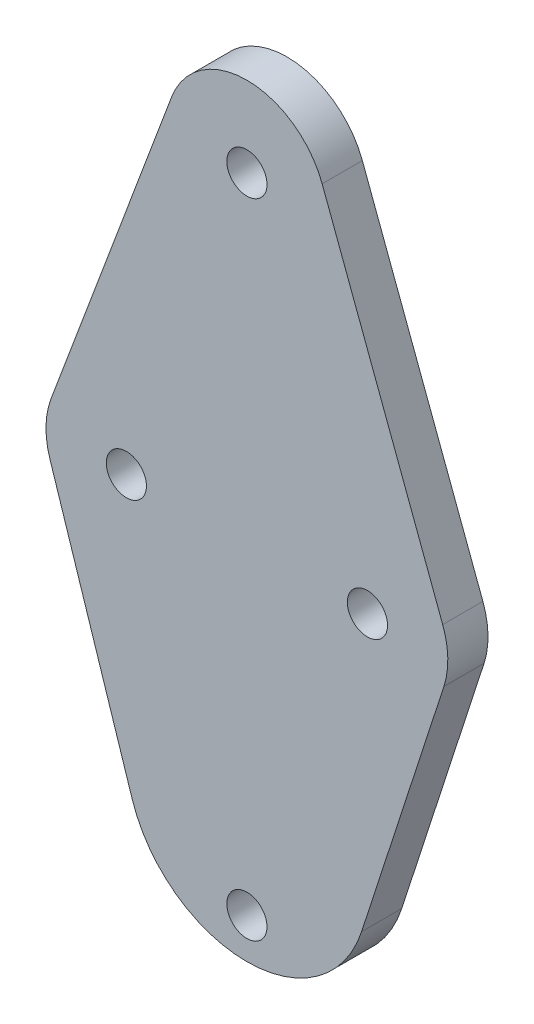
ISO-10303-21;
HEADER;
FILE_DESCRIPTION(('STEP AP214'),'2;1');
FILE_NAME('part.step','',(''),(''),'','','');
FILE_SCHEMA(('AUTOMOTIVE_DESIGN { 1 0 10303 214 1 1 1 1 }'));
ENDSEC;
DATA;
#1=APPLICATION_CONTEXT('core data for automotive mechanical design processes');
#2=APPLICATION_PROTOCOL_DEFINITION('international standard','automotive_design',2000,#1);
#3=PRODUCT_CONTEXT('',#1,'mechanical');
#4=PRODUCT('Part','Part','',(#3));
#5=PRODUCT_RELATED_PRODUCT_CATEGORY('part','',(#4));
#6=PRODUCT_DEFINITION_FORMATION('','',#4);
#7=PRODUCT_DEFINITION_CONTEXT('part definition',#1,'design');
#8=PRODUCT_DEFINITION('design','',#6,#7);
#9=PRODUCT_DEFINITION_SHAPE('','',#8);
#10=(LENGTH_UNIT() NAMED_UNIT(*) SI_UNIT(.MILLI.,.METRE.));
#11=(NAMED_UNIT(*) PLANE_ANGLE_UNIT() SI_UNIT($,.RADIAN.));
#12=(NAMED_UNIT(*) SI_UNIT($,.STERADIAN.) SOLID_ANGLE_UNIT());
#13=UNCERTAINTY_MEASURE_WITH_UNIT(LENGTH_MEASURE(1.E-05),#10,'distance_accuracy_value','');
#14=(GEOMETRIC_REPRESENTATION_CONTEXT(3) GLOBAL_UNCERTAINTY_ASSIGNED_CONTEXT((#13)) GLOBAL_UNIT_ASSIGNED_CONTEXT((#10,
#11,#12)) REPRESENTATION_CONTEXT('',''));
#15=CARTESIAN_POINT('',(0.,0.,0.));
#16=DIRECTION('',(0.,0.,1.));
#17=DIRECTION('',(1.,0.,0.));
#18=AXIS2_PLACEMENT_3D('',#15,#16,#17);
#19=CARTESIAN_POINT('',(0.,40.,5.));
#20=DIRECTION('',(0.,0.,-1.));
#21=DIRECTION('',(-1.,0.,0.));
#22=AXIS2_PLACEMENT_3D('',#19,#20,#21);
#23=CYLINDRICAL_SURFACE('',#22,10.);
#24=CARTESIAN_POINT('',(0.,40.,0.));
#25=DIRECTION('',(0.,0.,1.));
#26=DIRECTION('',(1.,0.,0.));
#27=AXIS2_PLACEMENT_3D('',#24,#25,#26);
#28=CIRCLE('',#27,10.);
#29=CARTESIAN_POINT('',(9.36329177569045,43.5112344158839,0.));
#30=VERTEX_POINT('',#29);
#31=CARTESIAN_POINT('',(-9.36329177569045,43.5112344158839,0.));
#32=VERTEX_POINT('',#31);
#33=EDGE_CURVE('E143',#30,#32,#28,.T.);
#34=ORIENTED_EDGE('',*,*,#33,.T.);
#35=DIRECTION('',(0.,0.,-1.));
#36=VECTOR('',#35,1.);
#37=CARTESIAN_POINT('',(-9.36329177569045,43.5112344158839,5.));
#38=LINE('',#37,#36);
#39=CARTESIAN_POINT('',(-9.36329177569045,43.5112344158839,5.));
#40=VERTEX_POINT('',#39);
#41=EDGE_CURVE('E11',#40,#32,#38,.T.);
#42=ORIENTED_EDGE('',*,*,#41,.F.);
#43=CARTESIAN_POINT('',(0.,40.,5.));
#44=DIRECTION('',(0.,0.,1.));
#45=DIRECTION('',(1.,0.,0.));
#46=AXIS2_PLACEMENT_3D('',#43,#44,#45);
#47=CIRCLE('',#46,10.);
#48=CARTESIAN_POINT('',(9.36329177569045,43.5112344158839,5.));
#49=VERTEX_POINT('',#48);
#50=EDGE_CURVE('E166',#49,#40,#47,.T.);
#51=ORIENTED_EDGE('',*,*,#50,.F.);
#52=DIRECTION('',(0.,0.,-1.));
#53=VECTOR('',#52,1.);
#54=CARTESIAN_POINT('',(9.36329177569045,43.5112344158839,5.));
#55=LINE('',#54,#53);
#56=EDGE_CURVE('E139',#49,#30,#55,.T.);
#57=ORIENTED_EDGE('',*,*,#56,.T.);
#58=EDGE_LOOP('',(#34,#42,#51,#57));
#59=FACE_BOUND('',#58,.T.);
#60=ADVANCED_FACE('F42',(#59),#23,.T.);
#61=CARTESIAN_POINT('',(-9.36329177569045,43.5112344158839,5.));
#62=DIRECTION('',(0.936329177569044,-0.351123441588392,0.));
#63=DIRECTION('',(0.351123441588392,0.936329177569044,0.));
#64=AXIS2_PLACEMENT_3D('',#61,#62,#63);
#65=PLANE('',#64);
#66=DIRECTION('',(-0.351123441588392,-0.936329177569044,0.));
#67=VECTOR('',#66,1.);
#68=CARTESIAN_POINT('',(-9.36329177569045,43.5112344158839,0.));
#69=LINE('',#68,#67);
#70=CARTESIAN_POINT('',(-24.3632917756905,3.51123441588391,0.));
#71=VERTEX_POINT('',#70);
#72=EDGE_CURVE('E147',#32,#71,#69,.T.);
#73=ORIENTED_EDGE('',*,*,#72,.T.);
#74=DIRECTION('',(0.,0.,-1.));
#75=VECTOR('',#74,1.);
#76=CARTESIAN_POINT('',(-24.3632917756905,3.51123441588391,5.));
#77=LINE('',#76,#75);
#78=CARTESIAN_POINT('',(-24.3632917756905,3.51123441588391,5.));
#79=VERTEX_POINT('',#78);
#80=EDGE_CURVE('E51',#79,#71,#77,.T.);
#81=ORIENTED_EDGE('',*,*,#80,.F.);
#82=DIRECTION('',(-0.351123441588392,-0.936329177569044,0.));
#83=VECTOR('',#82,1.);
#84=CARTESIAN_POINT('',(-9.36329177569045,43.5112344158839,5.));
#85=LINE('',#84,#83);
#86=EDGE_CURVE('E102',#40,#79,#85,.T.);
#87=ORIENTED_EDGE('',*,*,#86,.F.);
#88=ORIENTED_EDGE('',*,*,#41,.T.);
#89=EDGE_LOOP('',(#73,#81,#87,#88));
#90=FACE_BOUND('',#89,.T.);
#91=ADVANCED_FACE('F276',(#90),#65,.F.);
#92=CARTESIAN_POINT('',(-15.,0.,5.));
#93=DIRECTION('',(0.,0.,-1.));
#94=DIRECTION('',(-1.,0.,0.));
#95=AXIS2_PLACEMENT_3D('',#92,#93,#94);
#96=CYLINDRICAL_SURFACE('',#95,9.99999999999999);
#97=CARTESIAN_POINT('',(-15.,0.,0.));
#98=DIRECTION('',(0.,0.,1.));
#99=DIRECTION('',(1.,0.,0.));
#100=AXIS2_PLACEMENT_3D('',#97,#98,#99);
#101=CIRCLE('',#100,9.99999999999999);
#102=CARTESIAN_POINT('',(-24.5109994409477,-3.0888330538072,0.));
#103=VERTEX_POINT('',#102);
#104=EDGE_CURVE('E151',#71,#103,#101,.T.);
#105=ORIENTED_EDGE('',*,*,#104,.T.);
#106=DIRECTION('',(0.,0.,-1.));
#107=VECTOR('',#106,1.);
#108=CARTESIAN_POINT('',(-24.5109994409477,-3.0888330538072,5.));
#109=LINE('',#108,#107);
#110=CARTESIAN_POINT('',(-24.5109994409477,-3.0888330538072,5.));
#111=VERTEX_POINT('',#110);
#112=EDGE_CURVE('E177',#111,#103,#109,.T.);
#113=ORIENTED_EDGE('',*,*,#112,.F.);
#114=CARTESIAN_POINT('',(-15.,0.,5.));
#115=DIRECTION('',(0.,0.,1.));
#116=DIRECTION('',(1.,0.,0.));
#117=AXIS2_PLACEMENT_3D('',#114,#115,#116);
#118=CIRCLE('',#117,9.99999999999999);
#119=EDGE_CURVE('E187',#79,#111,#118,.T.);
#120=ORIENTED_EDGE('',*,*,#119,.F.);
#121=ORIENTED_EDGE('',*,*,#80,.T.);
#122=EDGE_LOOP('',(#105,#113,#120,#121));
#123=FACE_BOUND('',#122,.T.);
#124=ADVANCED_FACE('F185',(#123),#96,.T.);
#125=CARTESIAN_POINT('',(-24.5109994409477,-3.0888330538072,5.));
#126=DIRECTION('',(0.951099944094773,0.30888330538072,0.));
#127=DIRECTION('',(-0.30888330538072,0.951099944094773,0.));
#128=AXIS2_PLACEMENT_3D('',#125,#126,#127);
#129=PLANE('',#128);
#130=DIRECTION('',(0.30888330538072,-0.951099944094773,0.));
#131=VECTOR('',#130,1.);
#132=CARTESIAN_POINT('',(-24.5109994409477,-3.0888330538072,0.));
#133=LINE('',#132,#131);
#134=CARTESIAN_POINT('',(-14.2664991614216,-34.6332495807108,0.));
#135=VERTEX_POINT('',#134);
#136=EDGE_CURVE('E154',#103,#135,#133,.T.);
#137=ORIENTED_EDGE('',*,*,#136,.T.);
#138=DIRECTION('',(0.,0.,-1.));
#139=VECTOR('',#138,1.);
#140=CARTESIAN_POINT('',(-14.2664991614216,-34.6332495807108,5.));
#141=LINE('',#140,#139);
#142=CARTESIAN_POINT('',(-14.2664991614216,-34.6332495807108,5.));
#143=VERTEX_POINT('',#142);
#144=EDGE_CURVE('E173',#143,#135,#141,.T.);
#145=ORIENTED_EDGE('',*,*,#144,.F.);
#146=DIRECTION('',(0.30888330538072,-0.951099944094773,0.));
#147=VECTOR('',#146,1.);
#148=CARTESIAN_POINT('',(-24.5109994409477,-3.0888330538072,5.));
#149=LINE('',#148,#147);
#150=EDGE_CURVE('E200',#111,#143,#149,.T.);
#151=ORIENTED_EDGE('',*,*,#150,.F.);
#152=ORIENTED_EDGE('',*,*,#112,.T.);
#153=EDGE_LOOP('',(#137,#145,#151,#152));
#154=FACE_BOUND('',#153,.T.);
#155=ADVANCED_FACE('F195',(#154),#129,.F.);
#156=CARTESIAN_POINT('',(0.,-30.,5.));
#157=DIRECTION('',(0.,0.,-1.));
#158=DIRECTION('',(-1.,0.,0.));
#159=AXIS2_PLACEMENT_3D('',#156,#157,#158);
#160=CYLINDRICAL_SURFACE('',#159,15.);
#161=CARTESIAN_POINT('',(0.,-30.,0.));
#162=DIRECTION('',(0.,0.,1.));
#163=DIRECTION('',(1.,0.,0.));
#164=AXIS2_PLACEMENT_3D('',#161,#162,#163);
#165=CIRCLE('',#164,15.);
#166=CARTESIAN_POINT('',(14.2664991614216,-34.6332495807108,0.));
#167=VERTEX_POINT('',#166);
#168=EDGE_CURVE('E157',#135,#167,#165,.T.);
#169=ORIENTED_EDGE('',*,*,#168,.T.);
#170=DIRECTION('',(0.,0.,-1.));
#171=VECTOR('',#170,1.);
#172=CARTESIAN_POINT('',(14.2664991614216,-34.6332495807108,5.));
#173=LINE('',#172,#171);
#174=CARTESIAN_POINT('',(14.2664991614216,-34.6332495807108,5.));
#175=VERTEX_POINT('',#174);
#176=EDGE_CURVE('E132',#175,#167,#173,.T.);
#177=ORIENTED_EDGE('',*,*,#176,.F.);
#178=CARTESIAN_POINT('',(0.,-30.,5.));
#179=DIRECTION('',(0.,0.,1.));
#180=DIRECTION('',(1.,0.,0.));
#181=AXIS2_PLACEMENT_3D('',#178,#179,#180);
#182=CIRCLE('',#181,15.);
#183=EDGE_CURVE('E121',#143,#175,#182,.T.);
#184=ORIENTED_EDGE('',*,*,#183,.F.);
#185=ORIENTED_EDGE('',*,*,#144,.T.);
#186=EDGE_LOOP('',(#169,#177,#184,#185));
#187=FACE_BOUND('',#186,.T.);
#188=ADVANCED_FACE('F198',(#187),#160,.T.);
#189=CARTESIAN_POINT('',(14.2664991614216,-34.6332495807108,5.));
#190=DIRECTION('',(-0.951099944094773,0.30888330538072,0.));
#191=DIRECTION('',(-0.30888330538072,-0.951099944094773,0.));
#192=AXIS2_PLACEMENT_3D('',#189,#190,#191);
#193=PLANE('',#192);
#194=DIRECTION('',(0.30888330538072,0.951099944094773,0.));
#195=VECTOR('',#194,1.);
#196=CARTESIAN_POINT('',(14.2664991614216,-34.6332495807108,0.));
#197=LINE('',#196,#195);
#198=CARTESIAN_POINT('',(24.5109994409477,-3.0888330538072,0.));
#199=VERTEX_POINT('',#198);
#200=EDGE_CURVE('E130',#167,#199,#197,.T.);
#201=ORIENTED_EDGE('',*,*,#200,.T.);
#202=DIRECTION('',(0.,0.,-1.));
#203=VECTOR('',#202,1.);
#204=CARTESIAN_POINT('',(24.5109994409477,-3.0888330538072,5.));
#205=LINE('',#204,#203);
#206=CARTESIAN_POINT('',(24.5109994409477,-3.0888330538072,5.));
#207=VERTEX_POINT('',#206);
#208=EDGE_CURVE('E127',#207,#199,#205,.T.);
#209=ORIENTED_EDGE('',*,*,#208,.F.);
#210=DIRECTION('',(0.30888330538072,0.951099944094773,0.));
#211=VECTOR('',#210,1.);
#212=CARTESIAN_POINT('',(14.2664991614216,-34.6332495807108,5.));
#213=LINE('',#212,#211);
#214=EDGE_CURVE('E115',#175,#207,#213,.T.);
#215=ORIENTED_EDGE('',*,*,#214,.F.);
#216=ORIENTED_EDGE('',*,*,#176,.T.);
#217=EDGE_LOOP('',(#201,#209,#215,#216));
#218=FACE_BOUND('',#217,.T.);
#219=ADVANCED_FACE('F128',(#218),#193,.F.);
#220=CARTESIAN_POINT('',(15.,0.,5.));
#221=DIRECTION('',(0.,0.,-1.));
#222=DIRECTION('',(-1.,0.,0.));
#223=AXIS2_PLACEMENT_3D('',#220,#221,#222);
#224=CYLINDRICAL_SURFACE('',#223,10.);
#225=CARTESIAN_POINT('',(15.,0.,0.));
#226=DIRECTION('',(0.,0.,1.));
#227=DIRECTION('',(-1.,0.,0.));
#228=AXIS2_PLACEMENT_3D('',#225,#226,#227);
#229=CIRCLE('',#228,10.);
#230=CARTESIAN_POINT('',(24.3632917756904,3.51123441588391,0.));
#231=VERTEX_POINT('',#230);
#232=EDGE_CURVE('E88',#199,#231,#229,.T.);
#233=ORIENTED_EDGE('',*,*,#232,.T.);
#234=DIRECTION('',(0.,0.,-1.));
#235=VECTOR('',#234,1.);
#236=CARTESIAN_POINT('',(24.3632917756904,3.51123441588391,5.));
#237=LINE('',#236,#235);
#238=CARTESIAN_POINT('',(24.3632917756904,3.51123441588391,5.));
#239=VERTEX_POINT('',#238);
#240=EDGE_CURVE('E133',#239,#231,#237,.T.);
#241=ORIENTED_EDGE('',*,*,#240,.F.);
#242=CARTESIAN_POINT('',(15.,0.,5.));
#243=DIRECTION('',(0.,0.,1.));
#244=DIRECTION('',(-1.,0.,0.));
#245=AXIS2_PLACEMENT_3D('',#242,#243,#244);
#246=CIRCLE('',#245,10.);
#247=EDGE_CURVE('E119',#207,#239,#246,.T.);
#248=ORIENTED_EDGE('',*,*,#247,.F.);
#249=ORIENTED_EDGE('',*,*,#208,.T.);
#250=EDGE_LOOP('',(#233,#241,#248,#249));
#251=FACE_BOUND('',#250,.T.);
#252=ADVANCED_FACE('F135',(#251),#224,.T.);
#253=CARTESIAN_POINT('',(24.3632917756904,3.51123441588391,5.));
#254=DIRECTION('',(-0.936329177569045,-0.351123441588391,0.));
#255=DIRECTION('',(0.351123441588391,-0.936329177569045,0.));
#256=AXIS2_PLACEMENT_3D('',#253,#254,#255);
#257=PLANE('',#256);
#258=DIRECTION('',(-0.351123441588391,0.936329177569045,0.));
#259=VECTOR('',#258,1.);
#260=CARTESIAN_POINT('',(24.3632917756904,3.51123441588391,0.));
#261=LINE('',#260,#259);
#262=EDGE_CURVE('E94',#231,#30,#261,.T.);
#263=ORIENTED_EDGE('',*,*,#262,.T.);
#264=ORIENTED_EDGE('',*,*,#56,.F.);
#265=DIRECTION('',(-0.351123441588391,0.936329177569045,0.));
#266=VECTOR('',#265,1.);
#267=CARTESIAN_POINT('',(24.3632917756904,3.51123441588391,5.));
#268=LINE('',#267,#266);
#269=EDGE_CURVE('E59',#239,#49,#268,.T.);
#270=ORIENTED_EDGE('',*,*,#269,.F.);
#271=ORIENTED_EDGE('',*,*,#240,.T.);
#272=EDGE_LOOP('',(#263,#264,#270,#271));
#273=FACE_BOUND('',#272,.T.);
#274=ADVANCED_FACE('F253',(#273),#257,.F.);
#275=CARTESIAN_POINT('',(0.,40.,5.));
#276=DIRECTION('',(0.,0.,1.));
#277=DIRECTION('',(1.,0.,0.));
#278=AXIS2_PLACEMENT_3D('',#275,#276,#277);
#279=PLANE('',#278);
#280=CARTESIAN_POINT('',(0.,40.,5.));
#281=DIRECTION('',(0.,0.,1.));
#282=DIRECTION('',(1.,0.,0.));
#283=AXIS2_PLACEMENT_3D('',#280,#281,#282);
#284=CIRCLE('',#283,2.5);
#285=CARTESIAN_POINT('',(2.5,40.,5.));
#286=VERTEX_POINT('',#285);
#287=EDGE_CURVE('E234',#286,#286,#284,.T.);
#288=ORIENTED_EDGE('',*,*,#287,.F.);
#289=EDGE_LOOP('',(#288));
#290=FACE_BOUND('',#289,.T.);
#291=CARTESIAN_POINT('',(0.,-40.,5.));
#292=DIRECTION('',(0.,0.,1.));
#293=DIRECTION('',(1.,0.,0.));
#294=AXIS2_PLACEMENT_3D('',#291,#292,#293);
#295=CIRCLE('',#294,2.5);
#296=CARTESIAN_POINT('',(2.5,-40.,5.));
#297=VERTEX_POINT('',#296);
#298=EDGE_CURVE('E230',#297,#297,#295,.T.);
#299=ORIENTED_EDGE('',*,*,#298,.F.);
#300=EDGE_LOOP('',(#299));
#301=FACE_BOUND('',#300,.T.);
#302=CARTESIAN_POINT('',(15.,0.,5.));
#303=DIRECTION('',(0.,0.,1.));
#304=DIRECTION('',(1.,0.,0.));
#305=AXIS2_PLACEMENT_3D('',#302,#303,#304);
#306=CIRCLE('',#305,2.5);
#307=CARTESIAN_POINT('',(17.5,0.,5.));
#308=VERTEX_POINT('',#307);
#309=EDGE_CURVE('E222',#308,#308,#306,.T.);
#310=ORIENTED_EDGE('',*,*,#309,.F.);
#311=EDGE_LOOP('',(#310));
#312=FACE_BOUND('',#311,.T.);
#313=CARTESIAN_POINT('',(-15.,0.,5.));
#314=DIRECTION('',(0.,0.,1.));
#315=DIRECTION('',(1.,0.,0.));
#316=AXIS2_PLACEMENT_3D('',#313,#314,#315);
#317=CIRCLE('',#316,2.5);
#318=CARTESIAN_POINT('',(-12.5,0.,5.));
#319=VERTEX_POINT('',#318);
#320=EDGE_CURVE('E214',#319,#319,#317,.T.);
#321=ORIENTED_EDGE('',*,*,#320,.F.);
#322=EDGE_LOOP('',(#321));
#323=FACE_BOUND('',#322,.T.);
#324=ORIENTED_EDGE('',*,*,#50,.T.);
#325=ORIENTED_EDGE('',*,*,#86,.T.);
#326=ORIENTED_EDGE('',*,*,#119,.T.);
#327=ORIENTED_EDGE('',*,*,#150,.T.);
#328=ORIENTED_EDGE('',*,*,#183,.T.);
#329=ORIENTED_EDGE('',*,*,#214,.T.);
#330=ORIENTED_EDGE('',*,*,#247,.T.);
#331=ORIENTED_EDGE('',*,*,#269,.T.);
#332=EDGE_LOOP('',(#324,#325,#326,#327,#328,#329,#330,#331));
#333=FACE_BOUND('',#332,.T.);
#334=ADVANCED_FACE('F117',(#290,#301,#312,#323,#333),#279,.T.);
#335=CARTESIAN_POINT('',(0.,40.,0.));
#336=DIRECTION('',(0.,0.,1.));
#337=DIRECTION('',(1.,0.,0.));
#338=AXIS2_PLACEMENT_3D('',#335,#336,#337);
#339=PLANE('',#338);
#340=CARTESIAN_POINT('',(0.,40.,0.));
#341=DIRECTION('',(0.,0.,1.));
#342=DIRECTION('',(1.,0.,0.));
#343=AXIS2_PLACEMENT_3D('',#340,#341,#342);
#344=CIRCLE('',#343,2.5);
#345=CARTESIAN_POINT('',(2.5,40.,0.));
#346=VERTEX_POINT('',#345);
#347=EDGE_CURVE('E148',#346,#346,#344,.T.);
#348=ORIENTED_EDGE('',*,*,#347,.T.);
#349=EDGE_LOOP('',(#348));
#350=FACE_BOUND('',#349,.T.);
#351=CARTESIAN_POINT('',(0.,-40.,0.));
#352=DIRECTION('',(0.,0.,1.));
#353=DIRECTION('',(1.,0.,0.));
#354=AXIS2_PLACEMENT_3D('',#351,#352,#353);
#355=CIRCLE('',#354,2.5);
#356=CARTESIAN_POINT('',(2.5,-40.,0.));
#357=VERTEX_POINT('',#356);
#358=EDGE_CURVE('E226',#357,#357,#355,.T.);
#359=ORIENTED_EDGE('',*,*,#358,.T.);
#360=EDGE_LOOP('',(#359));
#361=FACE_BOUND('',#360,.T.);
#362=CARTESIAN_POINT('',(15.,0.,0.));
#363=DIRECTION('',(0.,0.,1.));
#364=DIRECTION('',(1.,0.,0.));
#365=AXIS2_PLACEMENT_3D('',#362,#363,#364);
#366=CIRCLE('',#365,2.5);
#367=CARTESIAN_POINT('',(17.5,0.,0.));
#368=VERTEX_POINT('',#367);
#369=EDGE_CURVE('E218',#368,#368,#366,.T.);
#370=ORIENTED_EDGE('',*,*,#369,.T.);
#371=EDGE_LOOP('',(#370));
#372=FACE_BOUND('',#371,.T.);
#373=CARTESIAN_POINT('',(-15.,0.,0.));
#374=DIRECTION('',(0.,0.,1.));
#375=DIRECTION('',(1.,0.,0.));
#376=AXIS2_PLACEMENT_3D('',#373,#374,#375);
#377=CIRCLE('',#376,2.5);
#378=CARTESIAN_POINT('',(-12.5,0.,0.));
#379=VERTEX_POINT('',#378);
#380=EDGE_CURVE('E210',#379,#379,#377,.T.);
#381=ORIENTED_EDGE('',*,*,#380,.T.);
#382=EDGE_LOOP('',(#381));
#383=FACE_BOUND('',#382,.T.);
#384=ORIENTED_EDGE('',*,*,#33,.F.);
#385=ORIENTED_EDGE('',*,*,#262,.F.);
#386=ORIENTED_EDGE('',*,*,#232,.F.);
#387=ORIENTED_EDGE('',*,*,#200,.F.);
#388=ORIENTED_EDGE('',*,*,#168,.F.);
#389=ORIENTED_EDGE('',*,*,#136,.F.);
#390=ORIENTED_EDGE('',*,*,#104,.F.);
#391=ORIENTED_EDGE('',*,*,#72,.F.);
#392=EDGE_LOOP('',(#384,#385,#386,#387,#388,#389,#390,#391));
#393=FACE_BOUND('',#392,.T.);
#394=ADVANCED_FACE('F191',(#350,#361,#372,#383,#393),#339,.F.);
#395=CARTESIAN_POINT('',(-15.,0.,0.));
#396=DIRECTION('',(0.,0.,1.));
#397=DIRECTION('',(1.,0.,0.));
#398=AXIS2_PLACEMENT_3D('',#395,#396,#397);
#399=CYLINDRICAL_SURFACE('',#398,2.5);
#400=ORIENTED_EDGE('',*,*,#380,.F.);
#401=EDGE_LOOP('',(#400));
#402=FACE_BOUND('',#401,.T.);
#403=ORIENTED_EDGE('',*,*,#320,.T.);
#404=EDGE_LOOP('',(#403));
#405=FACE_BOUND('',#404,.T.);
#406=ADVANCED_FACE('F261',(#402,#405),#399,.F.);
#407=CARTESIAN_POINT('',(15.,0.,0.));
#408=DIRECTION('',(0.,0.,1.));
#409=DIRECTION('',(1.,0.,0.));
#410=AXIS2_PLACEMENT_3D('',#407,#408,#409);
#411=CYLINDRICAL_SURFACE('',#410,2.5);
#412=ORIENTED_EDGE('',*,*,#369,.F.);
#413=EDGE_LOOP('',(#412));
#414=FACE_BOUND('',#413,.T.);
#415=ORIENTED_EDGE('',*,*,#309,.T.);
#416=EDGE_LOOP('',(#415));
#417=FACE_BOUND('',#416,.T.);
#418=ADVANCED_FACE('F263',(#414,#417),#411,.F.);
#419=CARTESIAN_POINT('',(0.,-40.,0.));
#420=DIRECTION('',(0.,0.,1.));
#421=DIRECTION('',(1.,0.,0.));
#422=AXIS2_PLACEMENT_3D('',#419,#420,#421);
#423=CYLINDRICAL_SURFACE('',#422,2.5);
#424=ORIENTED_EDGE('',*,*,#358,.F.);
#425=EDGE_LOOP('',(#424));
#426=FACE_BOUND('',#425,.T.);
#427=ORIENTED_EDGE('',*,*,#298,.T.);
#428=EDGE_LOOP('',(#427));
#429=FACE_BOUND('',#428,.T.);
#430=ADVANCED_FACE('F247',(#426,#429),#423,.F.);
#431=CARTESIAN_POINT('',(0.,40.,0.));
#432=DIRECTION('',(0.,0.,1.));
#433=DIRECTION('',(1.,0.,0.));
#434=AXIS2_PLACEMENT_3D('',#431,#432,#433);
#435=CYLINDRICAL_SURFACE('',#434,2.5);
#436=ORIENTED_EDGE('',*,*,#347,.F.);
#437=EDGE_LOOP('',(#436));
#438=FACE_BOUND('',#437,.T.);
#439=ORIENTED_EDGE('',*,*,#287,.T.);
#440=EDGE_LOOP('',(#439));
#441=FACE_BOUND('',#440,.T.);
#442=ADVANCED_FACE('F244',(#438,#441),#435,.F.);
#443=CLOSED_SHELL('',(#60,#91,#124,#155,#188,#219,#252,#274,#334,#394,#406,#418,#430,#442));
#444=MANIFOLD_SOLID_BREP('B2',#443);
#445=ADVANCED_BREP_SHAPE_REPRESENTATION('',(#18,#444),#14);
#446=SHAPE_DEFINITION_REPRESENTATION(#9,#445);
ENDSEC;
END-ISO-10303-21;
